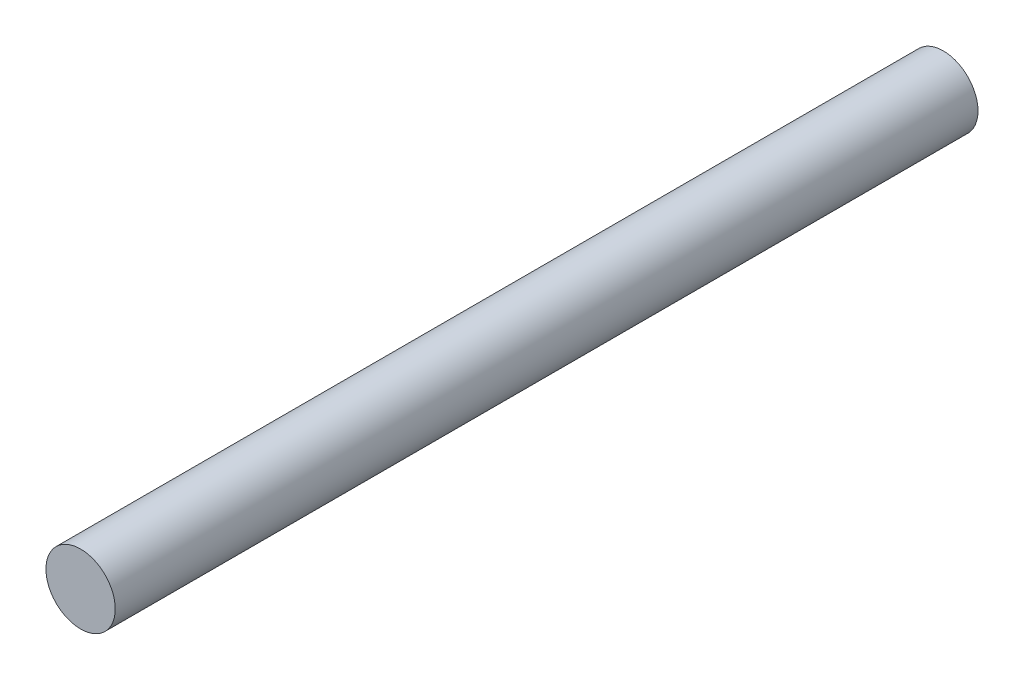
ISO-10303-21;
HEADER;
FILE_DESCRIPTION(('STEP AP214'),'2;1');
FILE_NAME('part.step','',(''),(''),'','','');
FILE_SCHEMA(('AUTOMOTIVE_DESIGN { 1 0 10303 214 1 1 1 1 }'));
ENDSEC;
DATA;
#1=APPLICATION_CONTEXT('core data for automotive mechanical design processes');
#2=APPLICATION_PROTOCOL_DEFINITION('international standard','automotive_design',2000,#1);
#3=PRODUCT_CONTEXT('',#1,'mechanical');
#4=PRODUCT('Part','Part','',(#3));
#5=PRODUCT_RELATED_PRODUCT_CATEGORY('part','',(#4));
#6=PRODUCT_DEFINITION_FORMATION('','',#4);
#7=PRODUCT_DEFINITION_CONTEXT('part definition',#1,'design');
#8=PRODUCT_DEFINITION('design','',#6,#7);
#9=PRODUCT_DEFINITION_SHAPE('','',#8);
#10=(LENGTH_UNIT() NAMED_UNIT(*) SI_UNIT(.MILLI.,.METRE.));
#11=(NAMED_UNIT(*) PLANE_ANGLE_UNIT() SI_UNIT($,.RADIAN.));
#12=(NAMED_UNIT(*) SI_UNIT($,.STERADIAN.) SOLID_ANGLE_UNIT());
#13=UNCERTAINTY_MEASURE_WITH_UNIT(LENGTH_MEASURE(1.E-05),#10,'distance_accuracy_value','');
#14=(GEOMETRIC_REPRESENTATION_CONTEXT(3) GLOBAL_UNCERTAINTY_ASSIGNED_CONTEXT((#13)) GLOBAL_UNIT_ASSIGNED_CONTEXT((#10,
#11,#12)) REPRESENTATION_CONTEXT('',''));
#15=CARTESIAN_POINT('',(0.,0.,0.));
#16=DIRECTION('',(0.,0.,1.));
#17=DIRECTION('',(1.,0.,0.));
#18=AXIS2_PLACEMENT_3D('',#15,#16,#17);
#19=CARTESIAN_POINT('',(0.,0.,99.568));
#20=DIRECTION('',(0.,0.,-1.));
#21=DIRECTION('',(-1.,0.,0.));
#22=AXIS2_PLACEMENT_3D('',#19,#20,#21);
#23=CYLINDRICAL_SURFACE('',#22,4.);
#24=CARTESIAN_POINT('',(0.,0.,99.568));
#25=DIRECTION('',(0.,0.,1.));
#26=DIRECTION('',(1.,0.,0.));
#27=AXIS2_PLACEMENT_3D('',#24,#25,#26);
#28=CIRCLE('',#27,4.);
#29=CARTESIAN_POINT('',(4.,0.,99.568));
#30=VERTEX_POINT('',#29);
#31=EDGE_CURVE('E10',#30,#30,#28,.T.);
#32=ORIENTED_EDGE('',*,*,#31,.F.);
#33=EDGE_LOOP('',(#32));
#34=FACE_BOUND('',#33,.T.);
#35=CARTESIAN_POINT('',(0.,0.,0.));
#36=DIRECTION('',(0.,0.,1.));
#37=DIRECTION('',(1.,0.,0.));
#38=AXIS2_PLACEMENT_3D('',#35,#36,#37);
#39=CIRCLE('',#38,4.);
#40=CARTESIAN_POINT('',(4.,0.,0.));
#41=VERTEX_POINT('',#40);
#42=EDGE_CURVE('E35',#41,#41,#39,.T.);
#43=ORIENTED_EDGE('',*,*,#42,.T.);
#44=EDGE_LOOP('',(#43));
#45=FACE_BOUND('',#44,.T.);
#46=ADVANCED_FACE('F32',(#34,#45),#23,.T.);
#47=CARTESIAN_POINT('',(0.,0.,99.568));
#48=DIRECTION('',(0.,0.,1.));
#49=DIRECTION('',(1.,0.,0.));
#50=AXIS2_PLACEMENT_3D('',#47,#48,#49);
#51=PLANE('',#50);
#52=ORIENTED_EDGE('',*,*,#31,.T.);
#53=EDGE_LOOP('',(#52));
#54=FACE_BOUND('',#53,.T.);
#55=ADVANCED_FACE('F47',(#54),#51,.T.);
#56=CARTESIAN_POINT('',(0.,0.,0.));
#57=DIRECTION('',(0.,0.,1.));
#58=DIRECTION('',(1.,0.,0.));
#59=AXIS2_PLACEMENT_3D('',#56,#57,#58);
#60=PLANE('',#59);
#61=ORIENTED_EDGE('',*,*,#42,.F.);
#62=EDGE_LOOP('',(#61));
#63=FACE_BOUND('',#62,.T.);
#64=ADVANCED_FACE('F45',(#63),#60,.F.);
#65=CLOSED_SHELL('',(#46,#55,#64));
#66=MANIFOLD_SOLID_BREP('B2',#65);
#67=ADVANCED_BREP_SHAPE_REPRESENTATION('',(#18,#66),#14);
#68=SHAPE_DEFINITION_REPRESENTATION(#9,#67);
ENDSEC;
END-ISO-10303-21;
